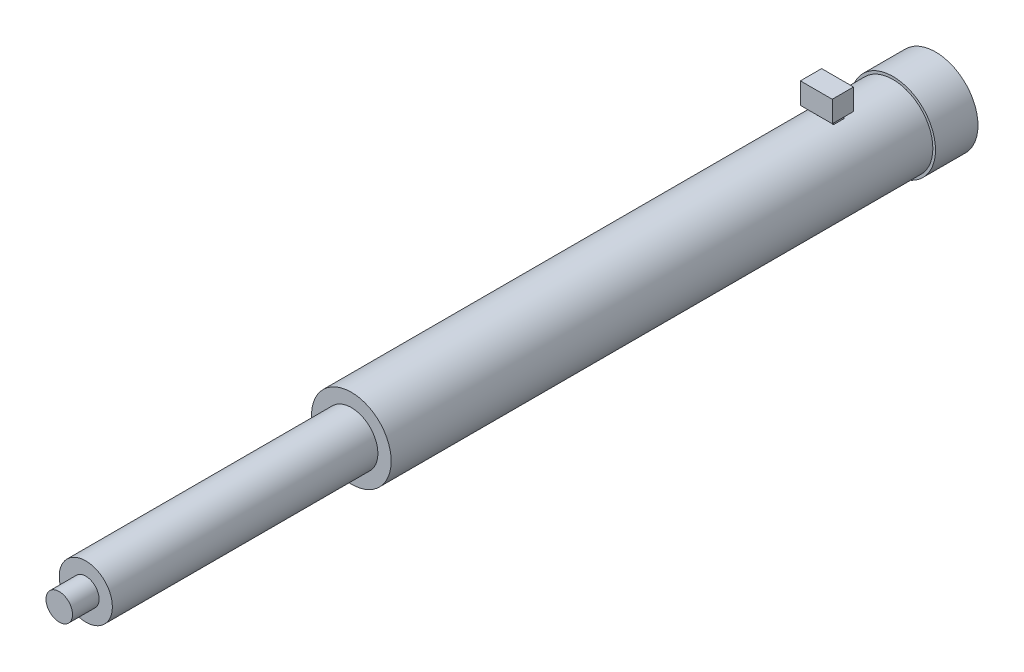
ISO-10303-21;
HEADER;
FILE_DESCRIPTION(('STEP AP214'),'2;1');
FILE_NAME('part.step','',(''),(''),'','','');
FILE_SCHEMA(('AUTOMOTIVE_DESIGN { 1 0 10303 214 1 1 1 1 }'));
ENDSEC;
DATA;
#1=APPLICATION_CONTEXT('core data for automotive mechanical design processes');
#2=APPLICATION_PROTOCOL_DEFINITION('international standard','automotive_design',2000,#1);
#3=PRODUCT_CONTEXT('',#1,'mechanical');
#4=PRODUCT('Part','Part','',(#3));
#5=PRODUCT_RELATED_PRODUCT_CATEGORY('part','',(#4));
#6=PRODUCT_DEFINITION_FORMATION('','',#4);
#7=PRODUCT_DEFINITION_CONTEXT('part definition',#1,'design');
#8=PRODUCT_DEFINITION('design','',#6,#7);
#9=PRODUCT_DEFINITION_SHAPE('','',#8);
#10=(LENGTH_UNIT() NAMED_UNIT(*) SI_UNIT(.MILLI.,.METRE.));
#11=(NAMED_UNIT(*) PLANE_ANGLE_UNIT() SI_UNIT($,.RADIAN.));
#12=(NAMED_UNIT(*) SI_UNIT($,.STERADIAN.) SOLID_ANGLE_UNIT());
#13=UNCERTAINTY_MEASURE_WITH_UNIT(LENGTH_MEASURE(1.E-05),#10,'distance_accuracy_value','');
#14=(GEOMETRIC_REPRESENTATION_CONTEXT(3) GLOBAL_UNCERTAINTY_ASSIGNED_CONTEXT((#13)) GLOBAL_UNIT_ASSIGNED_CONTEXT((#10,
#11,#12)) REPRESENTATION_CONTEXT('',''));
#15=CARTESIAN_POINT('',(0.,0.,0.));
#16=DIRECTION('',(0.,0.,1.));
#17=DIRECTION('',(1.,0.,0.));
#18=AXIS2_PLACEMENT_3D('',#15,#16,#17);
#19=CARTESIAN_POINT('',(0.,0.,139.7));
#20=DIRECTION('',(0.,0.,-1.));
#21=DIRECTION('',(-1.,0.,0.));
#22=AXIS2_PLACEMENT_3D('',#19,#20,#21);
#23=CYLINDRICAL_SURFACE('',#22,9.525);
#24=CARTESIAN_POINT('',(0.,0.,26.4554283268828));
#25=DIRECTION('',(0.,0.,-1.));
#26=DIRECTION('',(-1.,0.,0.));
#27=AXIS2_PLACEMENT_3D('',#24,#25,#26);
#28=CIRCLE('',#27,9.525);
#29=CARTESIAN_POINT('',(0.762000000000005,9.49447107531536,26.4554283268828));
#30=VERTEX_POINT('',#29);
#31=CARTESIAN_POINT('',(2.03200000000001,9.30572947167496,26.4554283268828));
#32=VERTEX_POINT('',#31);
#33=EDGE_CURVE('E228',#30,#32,#28,.T.);
#34=ORIENTED_EDGE('',*,*,#33,.F.);
#35=DIRECTION('',(0.,0.,-1.));
#36=VECTOR('',#35,1.);
#37=CARTESIAN_POINT('',(0.762000000000005,9.49447107531536,139.7));
#38=LINE('',#37,#36);
#39=CARTESIAN_POINT('',(0.762000000000005,9.49447107531536,23.9154283268828));
#40=VERTEX_POINT('',#39);
#41=EDGE_CURVE('E202',#30,#40,#38,.T.);
#42=ORIENTED_EDGE('',*,*,#41,.T.);
#43=CARTESIAN_POINT('',(0.,0.,23.9154283268828));
#44=DIRECTION('',(0.,0.,-1.));
#45=DIRECTION('',(-1.,0.,0.));
#46=AXIS2_PLACEMENT_3D('',#43,#44,#45);
#47=CIRCLE('',#46,9.525);
#48=CARTESIAN_POINT('',(2.03200000000001,9.30572947167496,23.9154283268828));
#49=VERTEX_POINT('',#48);
#50=EDGE_CURVE('E222',#40,#49,#47,.T.);
#51=ORIENTED_EDGE('',*,*,#50,.T.);
#52=DIRECTION('',(0.,0.,-1.));
#53=VECTOR('',#52,1.);
#54=CARTESIAN_POINT('',(2.03200000000001,9.30572947167496,139.7));
#55=LINE('',#54,#53);
#56=EDGE_CURVE('E225',#49,#32,#55,.F.);
#57=ORIENTED_EDGE('',*,*,#56,.T.);
#58=EDGE_LOOP('',(#34,#42,#51,#57));
#59=FACE_BOUND('',#58,.T.);
#60=CARTESIAN_POINT('',(0.,0.,139.7));
#61=DIRECTION('',(0.,0.,1.));
#62=DIRECTION('',(1.,0.,0.));
#63=AXIS2_PLACEMENT_3D('',#60,#61,#62);
#64=CIRCLE('',#63,9.525);
#65=CARTESIAN_POINT('',(9.525,0.,139.7));
#66=VERTEX_POINT('',#65);
#67=EDGE_CURVE('E206',#66,#66,#64,.T.);
#68=ORIENTED_EDGE('',*,*,#67,.F.);
#69=EDGE_LOOP('',(#68));
#70=FACE_BOUND('',#69,.T.);
#71=CARTESIAN_POINT('',(0.,0.,10.16));
#72=DIRECTION('',(0.,0.,1.));
#73=DIRECTION('',(1.,0.,0.));
#74=AXIS2_PLACEMENT_3D('',#71,#72,#73);
#75=CIRCLE('',#74,9.525);
#76=CARTESIAN_POINT('',(9.525,0.,10.16));
#77=VERTEX_POINT('',#76);
#78=EDGE_CURVE('E209',#77,#77,#75,.T.);
#79=ORIENTED_EDGE('',*,*,#78,.T.);
#80=EDGE_LOOP('',(#79));
#81=FACE_BOUND('',#80,.T.);
#82=CARTESIAN_POINT('',(0.,0.,26.4554283268828));
#83=DIRECTION('',(0.,0.,-1.));
#84=DIRECTION('',(-1.,0.,0.));
#85=AXIS2_PLACEMENT_3D('',#82,#83,#84);
#86=CIRCLE('',#85,9.525);
#87=CARTESIAN_POINT('',(-2.032,9.30572947167497,26.4554283268828));
#88=VERTEX_POINT('',#87);
#89=CARTESIAN_POINT('',(-0.761999999999996,9.49447107531536,26.4554283268828));
#90=VERTEX_POINT('',#89);
#91=EDGE_CURVE('E11',#88,#90,#86,.T.);
#92=ORIENTED_EDGE('',*,*,#91,.F.);
#93=DIRECTION('',(0.,0.,-1.));
#94=VECTOR('',#93,1.);
#95=CARTESIAN_POINT('',(-2.032,9.30572947167497,139.7));
#96=LINE('',#95,#94);
#97=CARTESIAN_POINT('',(-2.032,9.30572947167497,23.9154283268828));
#98=VERTEX_POINT('',#97);
#99=EDGE_CURVE('E230',#88,#98,#96,.T.);
#100=ORIENTED_EDGE('',*,*,#99,.T.);
#101=CARTESIAN_POINT('',(0.,0.,23.9154283268828));
#102=DIRECTION('',(0.,0.,-1.));
#103=DIRECTION('',(-1.,0.,0.));
#104=AXIS2_PLACEMENT_3D('',#101,#102,#103);
#105=CIRCLE('',#104,9.525);
#106=CARTESIAN_POINT('',(-0.761999999999996,9.49447107531536,23.9154283268828));
#107=VERTEX_POINT('',#106);
#108=EDGE_CURVE('E233',#98,#107,#105,.T.);
#109=ORIENTED_EDGE('',*,*,#108,.T.);
#110=DIRECTION('',(0.,0.,-1.));
#111=VECTOR('',#110,1.);
#112=CARTESIAN_POINT('',(-0.761999999999996,9.49447107531536,139.7));
#113=LINE('',#112,#111);
#114=EDGE_CURVE('E43',#107,#90,#113,.F.);
#115=ORIENTED_EDGE('',*,*,#114,.T.);
#116=EDGE_LOOP('',(#92,#100,#109,#115));
#117=FACE_BOUND('',#116,.T.);
#118=ADVANCED_FACE('F35',(#59,#70,#81,#117),#23,.T.);
#119=CARTESIAN_POINT('',(0.,0.,10.16));
#120=DIRECTION('',(0.,0.,-1.));
#121=DIRECTION('',(-1.,0.,0.));
#122=AXIS2_PLACEMENT_3D('',#119,#120,#121);
#123=CYLINDRICAL_SURFACE('',#122,10.16);
#124=CARTESIAN_POINT('',(0.,0.,10.16));
#125=DIRECTION('',(0.,0.,1.));
#126=DIRECTION('',(1.,0.,0.));
#127=AXIS2_PLACEMENT_3D('',#124,#125,#126);
#128=CIRCLE('',#127,10.16);
#129=CARTESIAN_POINT('',(10.16,0.,10.16));
#130=VERTEX_POINT('',#129);
#131=EDGE_CURVE('E215',#130,#130,#128,.T.);
#132=ORIENTED_EDGE('',*,*,#131,.F.);
#133=EDGE_LOOP('',(#132));
#134=FACE_BOUND('',#133,.T.);
#135=CARTESIAN_POINT('',(0.,0.,0.));
#136=DIRECTION('',(0.,0.,1.));
#137=DIRECTION('',(1.,0.,0.));
#138=AXIS2_PLACEMENT_3D('',#135,#136,#137);
#139=CIRCLE('',#138,10.16);
#140=CARTESIAN_POINT('',(10.16,0.,0.));
#141=VERTEX_POINT('',#140);
#142=EDGE_CURVE('E212',#141,#141,#139,.T.);
#143=ORIENTED_EDGE('',*,*,#142,.T.);
#144=EDGE_LOOP('',(#143));
#145=FACE_BOUND('',#144,.T.);
#146=ADVANCED_FACE('F37',(#134,#145),#123,.T.);
#147=CARTESIAN_POINT('',(0.,0.,10.16));
#148=DIRECTION('',(0.,0.,1.));
#149=DIRECTION('',(1.,0.,0.));
#150=AXIS2_PLACEMENT_3D('',#147,#148,#149);
#151=PLANE('',#150);
#152=ORIENTED_EDGE('',*,*,#78,.F.);
#153=EDGE_LOOP('',(#152));
#154=FACE_BOUND('',#153,.T.);
#155=ORIENTED_EDGE('',*,*,#131,.T.);
#156=EDGE_LOOP('',(#155));
#157=FACE_BOUND('',#156,.T.);
#158=ADVANCED_FACE('F269',(#154,#157),#151,.T.);
#159=CARTESIAN_POINT('',(0.,0.,0.));
#160=DIRECTION('',(0.,0.,1.));
#161=DIRECTION('',(1.,0.,0.));
#162=AXIS2_PLACEMENT_3D('',#159,#160,#161);
#163=PLANE('',#162);
#164=ORIENTED_EDGE('',*,*,#142,.F.);
#165=EDGE_LOOP('',(#164));
#166=FACE_BOUND('',#165,.T.);
#167=ADVANCED_FACE('F278',(#166),#163,.F.);
#168=CARTESIAN_POINT('',(0.,0.,139.7));
#169=DIRECTION('',(0.,0.,1.));
#170=DIRECTION('',(1.,0.,0.));
#171=AXIS2_PLACEMENT_3D('',#168,#169,#170);
#172=PLANE('',#171);
#173=CARTESIAN_POINT('',(0.,0.,139.7));
#174=DIRECTION('',(0.,0.,1.));
#175=DIRECTION('',(1.,0.,0.));
#176=AXIS2_PLACEMENT_3D('',#173,#174,#175);
#177=CIRCLE('',#176,6.35);
#178=CARTESIAN_POINT('',(6.35,0.,139.7));
#179=VERTEX_POINT('',#178);
#180=EDGE_CURVE('E203',#179,#179,#177,.T.);
#181=ORIENTED_EDGE('',*,*,#180,.F.);
#182=EDGE_LOOP('',(#181));
#183=FACE_BOUND('',#182,.T.);
#184=ORIENTED_EDGE('',*,*,#67,.T.);
#185=EDGE_LOOP('',(#184));
#186=FACE_BOUND('',#185,.T.);
#187=ADVANCED_FACE('F275',(#183,#186),#172,.T.);
#188=CARTESIAN_POINT('',(0.,0.,203.2));
#189=DIRECTION('',(0.,0.,-1.));
#190=DIRECTION('',(-1.,0.,0.));
#191=AXIS2_PLACEMENT_3D('',#188,#189,#190);
#192=CYLINDRICAL_SURFACE('',#191,6.35);
#193=CARTESIAN_POINT('',(0.,0.,203.2));
#194=DIRECTION('',(0.,0.,1.));
#195=DIRECTION('',(1.,0.,0.));
#196=AXIS2_PLACEMENT_3D('',#193,#194,#195);
#197=CIRCLE('',#196,6.35);
#198=CARTESIAN_POINT('',(6.35,0.,203.2));
#199=VERTEX_POINT('',#198);
#200=EDGE_CURVE('E198',#199,#199,#197,.T.);
#201=ORIENTED_EDGE('',*,*,#200,.F.);
#202=EDGE_LOOP('',(#201));
#203=FACE_BOUND('',#202,.T.);
#204=ORIENTED_EDGE('',*,*,#180,.T.);
#205=EDGE_LOOP('',(#204));
#206=FACE_BOUND('',#205,.T.);
#207=ADVANCED_FACE('F285',(#203,#206),#192,.T.);
#208=CARTESIAN_POINT('',(0.,0.,203.2));
#209=DIRECTION('',(0.,0.,1.));
#210=DIRECTION('',(1.,0.,0.));
#211=AXIS2_PLACEMENT_3D('',#208,#209,#210);
#212=PLANE('',#211);
#213=CARTESIAN_POINT('',(0.,0.,203.2));
#214=DIRECTION('',(0.,0.,1.));
#215=DIRECTION('',(1.,0.,0.));
#216=AXIS2_PLACEMENT_3D('',#213,#214,#215);
#217=CIRCLE('',#216,3.175);
#218=CARTESIAN_POINT('',(3.175,0.,203.2));
#219=VERTEX_POINT('',#218);
#220=EDGE_CURVE('E199',#219,#219,#217,.T.);
#221=ORIENTED_EDGE('',*,*,#220,.F.);
#222=EDGE_LOOP('',(#221));
#223=FACE_BOUND('',#222,.T.);
#224=ORIENTED_EDGE('',*,*,#200,.T.);
#225=EDGE_LOOP('',(#224));
#226=FACE_BOUND('',#225,.T.);
#227=ADVANCED_FACE('F292',(#223,#226),#212,.T.);
#228=CARTESIAN_POINT('',(0.,0.,209.55));
#229=DIRECTION('',(0.,0.,-1.));
#230=DIRECTION('',(-1.,0.,0.));
#231=AXIS2_PLACEMENT_3D('',#228,#229,#230);
#232=CYLINDRICAL_SURFACE('',#231,3.175);
#233=CARTESIAN_POINT('',(0.,0.,209.55));
#234=DIRECTION('',(0.,0.,1.));
#235=DIRECTION('',(1.,0.,0.));
#236=AXIS2_PLACEMENT_3D('',#233,#234,#235);
#237=CIRCLE('',#236,3.175);
#238=CARTESIAN_POINT('',(3.175,0.,209.55));
#239=VERTEX_POINT('',#238);
#240=EDGE_CURVE('E195',#239,#239,#237,.T.);
#241=ORIENTED_EDGE('',*,*,#240,.F.);
#242=EDGE_LOOP('',(#241));
#243=FACE_BOUND('',#242,.T.);
#244=ORIENTED_EDGE('',*,*,#220,.T.);
#245=EDGE_LOOP('',(#244));
#246=FACE_BOUND('',#245,.T.);
#247=ADVANCED_FACE('F305',(#243,#246),#232,.T.);
#248=CARTESIAN_POINT('',(0.,0.,209.55));
#249=DIRECTION('',(0.,0.,1.));
#250=DIRECTION('',(1.,0.,0.));
#251=AXIS2_PLACEMENT_3D('',#248,#249,#250);
#252=PLANE('',#251);
#253=ORIENTED_EDGE('',*,*,#240,.T.);
#254=EDGE_LOOP('',(#253));
#255=FACE_BOUND('',#254,.T.);
#256=ADVANCED_FACE('F312',(#255),#252,.T.);
#257=CARTESIAN_POINT('',(2.03200000000001,11.43,23.9154283268828));
#258=DIRECTION('',(1.,0.,0.));
#259=DIRECTION('',(0.,0.,-1.));
#260=AXIS2_PLACEMENT_3D('',#257,#258,#259);
#261=PLANE('',#260);
#262=ORIENTED_EDGE('',*,*,#56,.F.);
#263=DIRECTION('',(0.,-1.,0.));
#264=VECTOR('',#263,1.);
#265=CARTESIAN_POINT('',(2.03200000000001,11.43,23.9154283268828));
#266=LINE('',#265,#264);
#267=CARTESIAN_POINT('',(2.03200000000001,11.43,23.9154283268828));
#268=VERTEX_POINT('',#267);
#269=EDGE_CURVE('E189',#268,#49,#266,.T.);
#270=ORIENTED_EDGE('',*,*,#269,.F.);
#271=DIRECTION('',(0.,0.,1.));
#272=VECTOR('',#271,1.);
#273=CARTESIAN_POINT('',(2.03200000000001,11.43,23.9154283268828));
#274=LINE('',#273,#272);
#275=CARTESIAN_POINT('',(2.03200000000001,11.43,26.4554283268828));
#276=VERTEX_POINT('',#275);
#277=EDGE_CURVE('E177',#268,#276,#274,.T.);
#278=ORIENTED_EDGE('',*,*,#277,.T.);
#279=DIRECTION('',(0.,-1.,0.));
#280=VECTOR('',#279,1.);
#281=CARTESIAN_POINT('',(2.03200000000001,11.43,26.4554283268828));
#282=LINE('',#281,#280);
#283=EDGE_CURVE('E192',#276,#32,#282,.T.);
#284=ORIENTED_EDGE('',*,*,#283,.T.);
#285=EDGE_LOOP('',(#262,#270,#278,#284));
#286=FACE_BOUND('',#285,.T.);
#287=ADVANCED_FACE('F316',(#286),#261,.T.);
#288=CARTESIAN_POINT('',(0.762000000000005,11.43,26.4554283268828));
#289=DIRECTION('',(-1.,0.,0.));
#290=DIRECTION('',(0.,0.,1.));
#291=AXIS2_PLACEMENT_3D('',#288,#289,#290);
#292=PLANE('',#291);
#293=ORIENTED_EDGE('',*,*,#41,.F.);
#294=DIRECTION('',(0.,-1.,0.));
#295=VECTOR('',#294,1.);
#296=CARTESIAN_POINT('',(0.762000000000005,11.43,26.4554283268828));
#297=LINE('',#296,#295);
#298=CARTESIAN_POINT('',(0.762000000000005,11.43,26.4554283268828));
#299=VERTEX_POINT('',#298);
#300=EDGE_CURVE('E185',#299,#30,#297,.T.);
#301=ORIENTED_EDGE('',*,*,#300,.F.);
#302=DIRECTION('',(0.,0.,-1.));
#303=VECTOR('',#302,1.);
#304=CARTESIAN_POINT('',(0.762000000000005,11.43,26.4554283268828));
#305=LINE('',#304,#303);
#306=CARTESIAN_POINT('',(0.762000000000005,11.43,23.9154283268828));
#307=VERTEX_POINT('',#306);
#308=EDGE_CURVE('E183',#299,#307,#305,.T.);
#309=ORIENTED_EDGE('',*,*,#308,.T.);
#310=DIRECTION('',(0.,-1.,0.));
#311=VECTOR('',#310,1.);
#312=CARTESIAN_POINT('',(0.762000000000005,11.43,23.9154283268828));
#313=LINE('',#312,#311);
#314=EDGE_CURVE('E58',#307,#40,#313,.T.);
#315=ORIENTED_EDGE('',*,*,#314,.T.);
#316=EDGE_LOOP('',(#293,#301,#309,#315));
#317=FACE_BOUND('',#316,.T.);
#318=ADVANCED_FACE('F321',(#317),#292,.T.);
#319=CARTESIAN_POINT('',(0.762000000000005,11.43,26.4554283268828));
#320=DIRECTION('',(0.,0.,-1.));
#321=DIRECTION('',(-1.,0.,0.));
#322=AXIS2_PLACEMENT_3D('',#319,#320,#321);
#323=PLANE('',#322);
#324=ORIENTED_EDGE('',*,*,#300,.T.);
#325=ORIENTED_EDGE('',*,*,#33,.T.);
#326=ORIENTED_EDGE('',*,*,#283,.F.);
#327=DIRECTION('',(1.,0.,0.));
#328=VECTOR('',#327,1.);
#329=CARTESIAN_POINT('',(0.762000000000005,11.43,26.4554283268828));
#330=LINE('',#329,#328);
#331=EDGE_CURVE('E175',#299,#276,#330,.T.);
#332=ORIENTED_EDGE('',*,*,#331,.F.);
#333=EDGE_LOOP('',(#324,#325,#326,#332));
#334=FACE_BOUND('',#333,.T.);
#335=ADVANCED_FACE('F318',(#334),#323,.F.);
#336=CARTESIAN_POINT('',(0.762000000000005,11.43,23.9154283268828));
#337=DIRECTION('',(0.,0.,-1.));
#338=DIRECTION('',(-1.,0.,0.));
#339=AXIS2_PLACEMENT_3D('',#336,#337,#338);
#340=PLANE('',#339);
#341=ORIENTED_EDGE('',*,*,#50,.F.);
#342=ORIENTED_EDGE('',*,*,#314,.F.);
#343=DIRECTION('',(1.,0.,0.));
#344=VECTOR('',#343,1.);
#345=CARTESIAN_POINT('',(0.762000000000005,11.43,23.9154283268828));
#346=LINE('',#345,#344);
#347=EDGE_CURVE('E180',#307,#268,#346,.T.);
#348=ORIENTED_EDGE('',*,*,#347,.T.);
#349=ORIENTED_EDGE('',*,*,#269,.T.);
#350=EDGE_LOOP('',(#341,#342,#348,#349));
#351=FACE_BOUND('',#350,.T.);
#352=ADVANCED_FACE('F259',(#351),#340,.T.);
#353=CARTESIAN_POINT('',(-0.761999999999996,11.43,23.9154283268828));
#354=DIRECTION('',(1.,0.,0.));
#355=DIRECTION('',(0.,0.,-1.));
#356=AXIS2_PLACEMENT_3D('',#353,#354,#355);
#357=PLANE('',#356);
#358=ORIENTED_EDGE('',*,*,#114,.F.);
#359=DIRECTION('',(0.,-1.,0.));
#360=VECTOR('',#359,1.);
#361=CARTESIAN_POINT('',(-0.761999999999996,11.43,23.9154283268828));
#362=LINE('',#361,#360);
#363=CARTESIAN_POINT('',(-0.761999999999996,11.43,23.9154283268828));
#364=VERTEX_POINT('',#363);
#365=EDGE_CURVE('E153',#364,#107,#362,.T.);
#366=ORIENTED_EDGE('',*,*,#365,.F.);
#367=DIRECTION('',(0.,0.,1.));
#368=VECTOR('',#367,1.);
#369=CARTESIAN_POINT('',(-0.761999999999996,11.43,23.9154283268828));
#370=LINE('',#369,#368);
#371=CARTESIAN_POINT('',(-0.761999999999996,11.43,26.4554283268828));
#372=VERTEX_POINT('',#371);
#373=EDGE_CURVE('E170',#364,#372,#370,.T.);
#374=ORIENTED_EDGE('',*,*,#373,.T.);
#375=DIRECTION('',(0.,-1.,0.));
#376=VECTOR('',#375,1.);
#377=CARTESIAN_POINT('',(-0.761999999999996,11.43,26.4554283268828));
#378=LINE('',#377,#376);
#379=EDGE_CURVE('E150',#372,#90,#378,.T.);
#380=ORIENTED_EDGE('',*,*,#379,.T.);
#381=EDGE_LOOP('',(#358,#366,#374,#380));
#382=FACE_BOUND('',#381,.T.);
#383=ADVANCED_FACE('F240',(#382),#357,.T.);
#384=CARTESIAN_POINT('',(-2.032,11.43,26.4554283268828));
#385=DIRECTION('',(-1.,0.,0.));
#386=DIRECTION('',(0.,0.,1.));
#387=AXIS2_PLACEMENT_3D('',#384,#385,#386);
#388=PLANE('',#387);
#389=ORIENTED_EDGE('',*,*,#99,.F.);
#390=DIRECTION('',(0.,-1.,0.));
#391=VECTOR('',#390,1.);
#392=CARTESIAN_POINT('',(-2.032,11.43,26.4554283268828));
#393=LINE('',#392,#391);
#394=CARTESIAN_POINT('',(-2.032,11.43,26.4554283268828));
#395=VERTEX_POINT('',#394);
#396=EDGE_CURVE('E162',#395,#88,#393,.T.);
#397=ORIENTED_EDGE('',*,*,#396,.F.);
#398=DIRECTION('',(0.,0.,-1.));
#399=VECTOR('',#398,1.);
#400=CARTESIAN_POINT('',(-2.032,11.43,26.4554283268828));
#401=LINE('',#400,#399);
#402=CARTESIAN_POINT('',(-2.032,11.43,23.9154283268828));
#403=VERTEX_POINT('',#402);
#404=EDGE_CURVE('E165',#395,#403,#401,.T.);
#405=ORIENTED_EDGE('',*,*,#404,.T.);
#406=DIRECTION('',(0.,-1.,0.));
#407=VECTOR('',#406,1.);
#408=CARTESIAN_POINT('',(-2.032,11.43,23.9154283268828));
#409=LINE('',#408,#407);
#410=EDGE_CURVE('E50',#403,#98,#409,.T.);
#411=ORIENTED_EDGE('',*,*,#410,.T.);
#412=EDGE_LOOP('',(#389,#397,#405,#411));
#413=FACE_BOUND('',#412,.T.);
#414=ADVANCED_FACE('F251',(#413),#388,.T.);
#415=CARTESIAN_POINT('',(-2.032,11.43,26.4554283268828));
#416=DIRECTION('',(0.,0.,-1.));
#417=DIRECTION('',(-1.,0.,0.));
#418=AXIS2_PLACEMENT_3D('',#415,#416,#417);
#419=PLANE('',#418);
#420=ORIENTED_EDGE('',*,*,#396,.T.);
#421=ORIENTED_EDGE('',*,*,#91,.T.);
#422=ORIENTED_EDGE('',*,*,#379,.F.);
#423=DIRECTION('',(1.,0.,0.));
#424=VECTOR('',#423,1.);
#425=CARTESIAN_POINT('',(-2.032,11.43,26.4554283268828));
#426=LINE('',#425,#424);
#427=EDGE_CURVE('E173',#395,#372,#426,.T.);
#428=ORIENTED_EDGE('',*,*,#427,.F.);
#429=EDGE_LOOP('',(#420,#421,#422,#428));
#430=FACE_BOUND('',#429,.T.);
#431=ADVANCED_FACE('F250',(#430),#419,.F.);
#432=CARTESIAN_POINT('',(-2.032,11.43,23.9154283268828));
#433=DIRECTION('',(0.,0.,-1.));
#434=DIRECTION('',(-1.,0.,0.));
#435=AXIS2_PLACEMENT_3D('',#432,#433,#434);
#436=PLANE('',#435);
#437=ORIENTED_EDGE('',*,*,#108,.F.);
#438=ORIENTED_EDGE('',*,*,#410,.F.);
#439=DIRECTION('',(1.,0.,0.));
#440=VECTOR('',#439,1.);
#441=CARTESIAN_POINT('',(-2.032,11.43,23.9154283268828));
#442=LINE('',#441,#440);
#443=EDGE_CURVE('E167',#403,#364,#442,.T.);
#444=ORIENTED_EDGE('',*,*,#443,.T.);
#445=ORIENTED_EDGE('',*,*,#365,.T.);
#446=EDGE_LOOP('',(#437,#438,#444,#445));
#447=FACE_BOUND('',#446,.T.);
#448=ADVANCED_FACE('F243',(#447),#436,.T.);
#449=CARTESIAN_POINT('',(3.81,16.51,23.4245139423374));
#450=DIRECTION('',(-1.,0.,0.));
#451=DIRECTION('',(0.,0.,1.));
#452=AXIS2_PLACEMENT_3D('',#449,#450,#451);
#453=PLANE('',#452);
#454=DIRECTION('',(0.,0.,-1.));
#455=VECTOR('',#454,1.);
#456=CARTESIAN_POINT('',(3.81,11.43,23.4245139423374));
#457=LINE('',#456,#455);
#458=CARTESIAN_POINT('',(3.81,11.43,28.5045139423374));
#459=VERTEX_POINT('',#458);
#460=CARTESIAN_POINT('',(3.81,11.43,23.4245139423374));
#461=VERTEX_POINT('',#460);
#462=EDGE_CURVE('E149',#459,#461,#457,.T.);
#463=ORIENTED_EDGE('',*,*,#462,.T.);
#464=DIRECTION('',(0.,-1.,0.));
#465=VECTOR('',#464,1.);
#466=CARTESIAN_POINT('',(3.81,16.51,23.4245139423374));
#467=LINE('',#466,#465);
#468=CARTESIAN_POINT('',(3.81,16.51,23.4245139423374));
#469=VERTEX_POINT('',#468);
#470=EDGE_CURVE('E129',#469,#461,#467,.T.);
#471=ORIENTED_EDGE('',*,*,#470,.F.);
#472=DIRECTION('',(0.,0.,-1.));
#473=VECTOR('',#472,1.);
#474=CARTESIAN_POINT('',(3.81,16.51,23.4245139423374));
#475=LINE('',#474,#473);
#476=CARTESIAN_POINT('',(3.81,16.51,28.5045139423374));
#477=VERTEX_POINT('',#476);
#478=EDGE_CURVE('E136',#477,#469,#475,.T.);
#479=ORIENTED_EDGE('',*,*,#478,.F.);
#480=DIRECTION('',(0.,-1.,0.));
#481=VECTOR('',#480,1.);
#482=CARTESIAN_POINT('',(3.81,16.51,28.5045139423374));
#483=LINE('',#482,#481);
#484=EDGE_CURVE('E488',#477,#459,#483,.T.);
#485=ORIENTED_EDGE('',*,*,#484,.T.);
#486=EDGE_LOOP('',(#463,#471,#479,#485));
#487=FACE_BOUND('',#486,.T.);
#488=ADVANCED_FACE('F147',(#487),#453,.F.);
#489=CARTESIAN_POINT('',(3.81,16.51,23.4245139423374));
#490=DIRECTION('',(0.,0.,1.));
#491=DIRECTION('',(1.,0.,0.));
#492=AXIS2_PLACEMENT_3D('',#489,#490,#491);
#493=PLANE('',#492);
#494=DIRECTION('',(-1.,0.,0.));
#495=VECTOR('',#494,1.);
#496=CARTESIAN_POINT('',(3.81,11.43,23.4245139423374));
#497=LINE('',#496,#495);
#498=CARTESIAN_POINT('',(-3.81,11.43,23.4245139423374));
#499=VERTEX_POINT('',#498);
#500=EDGE_CURVE('E486',#461,#499,#497,.T.);
#501=ORIENTED_EDGE('',*,*,#500,.T.);
#502=DIRECTION('',(0.,-1.,0.));
#503=VECTOR('',#502,1.);
#504=CARTESIAN_POINT('',(-3.81,16.51,23.4245139423374));
#505=LINE('',#504,#503);
#506=CARTESIAN_POINT('',(-3.81,16.51,23.4245139423374));
#507=VERTEX_POINT('',#506);
#508=EDGE_CURVE('E132',#507,#499,#505,.T.);
#509=ORIENTED_EDGE('',*,*,#508,.F.);
#510=DIRECTION('',(-1.,0.,0.));
#511=VECTOR('',#510,1.);
#512=CARTESIAN_POINT('',(3.81,16.51,23.4245139423374));
#513=LINE('',#512,#511);
#514=EDGE_CURVE('E125',#469,#507,#513,.T.);
#515=ORIENTED_EDGE('',*,*,#514,.F.);
#516=ORIENTED_EDGE('',*,*,#470,.T.);
#517=EDGE_LOOP('',(#501,#509,#515,#516));
#518=FACE_BOUND('',#517,.T.);
#519=ADVANCED_FACE('F127',(#518),#493,.F.);
#520=CARTESIAN_POINT('',(-3.81,16.51,23.4245139423374));
#521=DIRECTION('',(1.,0.,0.));
#522=DIRECTION('',(0.,0.,-1.));
#523=AXIS2_PLACEMENT_3D('',#520,#521,#522);
#524=PLANE('',#523);
#525=DIRECTION('',(0.,0.,1.));
#526=VECTOR('',#525,1.);
#527=CARTESIAN_POINT('',(-3.81,11.43,23.4245139423374));
#528=LINE('',#527,#526);
#529=CARTESIAN_POINT('',(-3.81,11.43,28.5045139423374));
#530=VERTEX_POINT('',#529);
#531=EDGE_CURVE('E483',#499,#530,#528,.T.);
#532=ORIENTED_EDGE('',*,*,#531,.T.);
#533=DIRECTION('',(0.,-1.,0.));
#534=VECTOR('',#533,1.);
#535=CARTESIAN_POINT('',(-3.81,16.51,28.5045139423374));
#536=LINE('',#535,#534);
#537=CARTESIAN_POINT('',(-3.81,16.51,28.5045139423374));
#538=VERTEX_POINT('',#537);
#539=EDGE_CURVE('E155',#538,#530,#536,.T.);
#540=ORIENTED_EDGE('',*,*,#539,.F.);
#541=DIRECTION('',(0.,0.,1.));
#542=VECTOR('',#541,1.);
#543=CARTESIAN_POINT('',(-3.81,16.51,23.4245139423374));
#544=LINE('',#543,#542);
#545=EDGE_CURVE('E135',#507,#538,#544,.T.);
#546=ORIENTED_EDGE('',*,*,#545,.F.);
#547=ORIENTED_EDGE('',*,*,#508,.T.);
#548=EDGE_LOOP('',(#532,#540,#546,#547));
#549=FACE_BOUND('',#548,.T.);
#550=ADVANCED_FACE('F346',(#549),#524,.F.);
#551=CARTESIAN_POINT('',(3.81,16.51,28.5045139423374));
#552=DIRECTION('',(0.,0.,-1.));
#553=DIRECTION('',(-1.,0.,0.));
#554=AXIS2_PLACEMENT_3D('',#551,#552,#553);
#555=PLANE('',#554);
#556=DIRECTION('',(1.,0.,0.));
#557=VECTOR('',#556,1.);
#558=CARTESIAN_POINT('',(3.81,11.43,28.5045139423374));
#559=LINE('',#558,#557);
#560=EDGE_CURVE('E145',#530,#459,#559,.T.);
#561=ORIENTED_EDGE('',*,*,#560,.T.);
#562=ORIENTED_EDGE('',*,*,#484,.F.);
#563=DIRECTION('',(1.,0.,0.));
#564=VECTOR('',#563,1.);
#565=CARTESIAN_POINT('',(3.81,16.51,28.5045139423374));
#566=LINE('',#565,#564);
#567=EDGE_CURVE('E141',#538,#477,#566,.T.);
#568=ORIENTED_EDGE('',*,*,#567,.F.);
#569=ORIENTED_EDGE('',*,*,#539,.T.);
#570=EDGE_LOOP('',(#561,#562,#568,#569));
#571=FACE_BOUND('',#570,.T.);
#572=ADVANCED_FACE('F341',(#571),#555,.F.);
#573=CARTESIAN_POINT('',(0.,16.51,0.));
#574=DIRECTION('',(0.,-1.,0.));
#575=DIRECTION('',(0.,0.,-1.));
#576=AXIS2_PLACEMENT_3D('',#573,#574,#575);
#577=PLANE('',#576);
#578=ORIENTED_EDGE('',*,*,#478,.T.);
#579=ORIENTED_EDGE('',*,*,#514,.T.);
#580=ORIENTED_EDGE('',*,*,#545,.T.);
#581=ORIENTED_EDGE('',*,*,#567,.T.);
#582=EDGE_LOOP('',(#578,#579,#580,#581));
#583=FACE_BOUND('',#582,.T.);
#584=ADVANCED_FACE('F139',(#583),#577,.F.);
#585=CARTESIAN_POINT('',(0.,11.43,0.));
#586=DIRECTION('',(0.,-1.,0.));
#587=DIRECTION('',(0.,0.,-1.));
#588=AXIS2_PLACEMENT_3D('',#585,#586,#587);
#589=PLANE('',#588);
#590=ORIENTED_EDGE('',*,*,#308,.F.);
#591=ORIENTED_EDGE('',*,*,#331,.T.);
#592=ORIENTED_EDGE('',*,*,#277,.F.);
#593=ORIENTED_EDGE('',*,*,#347,.F.);
#594=EDGE_LOOP('',(#590,#591,#592,#593));
#595=FACE_BOUND('',#594,.T.);
#596=ORIENTED_EDGE('',*,*,#404,.F.);
#597=ORIENTED_EDGE('',*,*,#427,.T.);
#598=ORIENTED_EDGE('',*,*,#373,.F.);
#599=ORIENTED_EDGE('',*,*,#443,.F.);
#600=EDGE_LOOP('',(#596,#597,#598,#599));
#601=FACE_BOUND('',#600,.T.);
#602=ORIENTED_EDGE('',*,*,#462,.F.);
#603=ORIENTED_EDGE('',*,*,#560,.F.);
#604=ORIENTED_EDGE('',*,*,#531,.F.);
#605=ORIENTED_EDGE('',*,*,#500,.F.);
#606=EDGE_LOOP('',(#602,#603,#604,#605));
#607=FACE_BOUND('',#606,.T.);
#608=ADVANCED_FACE('F245',(#595,#601,#607),#589,.T.);
#609=CLOSED_SHELL('',(#118,#146,#158,#167,#187,#207,#227,#247,#256,#287,#318,#335,#352,#383,
#414,#431,#448,#488,#519,#550,#572,#584,#608));
#610=MANIFOLD_SOLID_BREP('B2',#609);
#611=ADVANCED_BREP_SHAPE_REPRESENTATION('',(#18,#610),#14);
#612=SHAPE_DEFINITION_REPRESENTATION(#9,#611);
ENDSEC;
END-ISO-10303-21;
